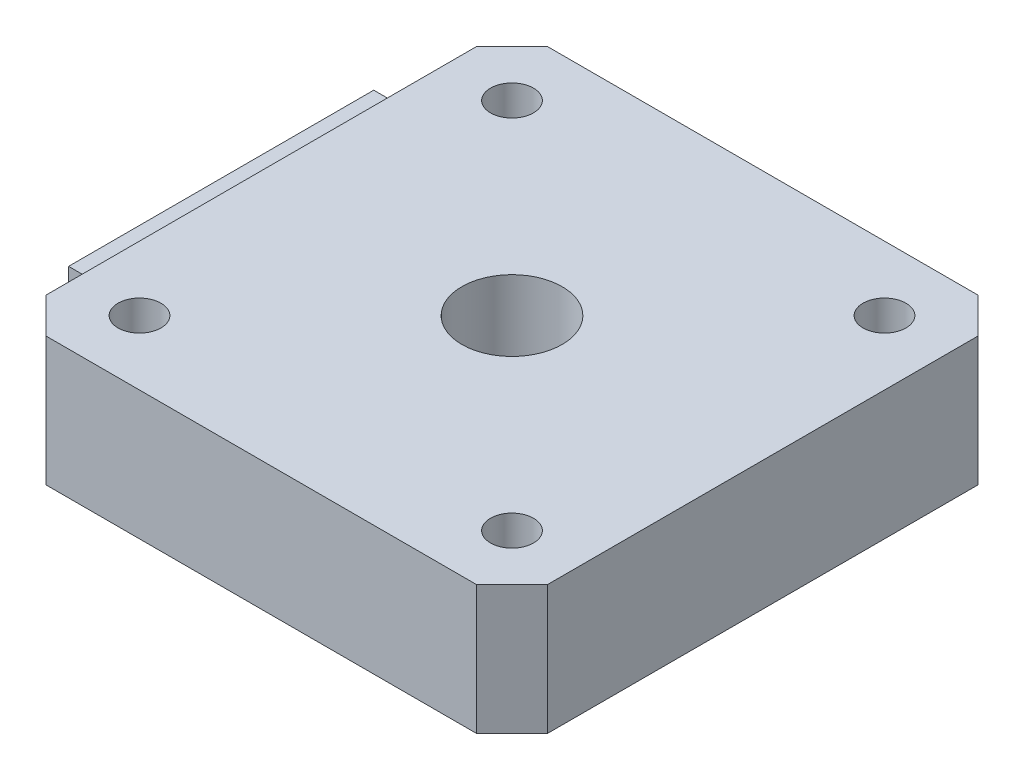
ISO-10303-21;
HEADER;
FILE_DESCRIPTION(('STEP AP214'),'2;1');
FILE_NAME('part.step','',(''),(''),'','','');
FILE_SCHEMA(('AUTOMOTIVE_DESIGN { 1 0 10303 214 1 1 1 1 }'));
ENDSEC;
DATA;
#1=APPLICATION_CONTEXT('core data for automotive mechanical design processes');
#2=APPLICATION_PROTOCOL_DEFINITION('international standard','automotive_design',2000,#1);
#3=PRODUCT_CONTEXT('',#1,'mechanical');
#4=PRODUCT('Part','Part','',(#3));
#5=PRODUCT_RELATED_PRODUCT_CATEGORY('part','',(#4));
#6=PRODUCT_DEFINITION_FORMATION('','',#4);
#7=PRODUCT_DEFINITION_CONTEXT('part definition',#1,'design');
#8=PRODUCT_DEFINITION('design','',#6,#7);
#9=PRODUCT_DEFINITION_SHAPE('','',#8);
#10=(LENGTH_UNIT() NAMED_UNIT(*) SI_UNIT(.MILLI.,.METRE.));
#11=(NAMED_UNIT(*) PLANE_ANGLE_UNIT() SI_UNIT($,.RADIAN.));
#12=(NAMED_UNIT(*) SI_UNIT($,.STERADIAN.) SOLID_ANGLE_UNIT());
#13=UNCERTAINTY_MEASURE_WITH_UNIT(LENGTH_MEASURE(1.E-05),#10,'distance_accuracy_value','');
#14=(GEOMETRIC_REPRESENTATION_CONTEXT(3) GLOBAL_UNCERTAINTY_ASSIGNED_CONTEXT((#13)) GLOBAL_UNIT_ASSIGNED_CONTEXT((#10,
#11,#12)) REPRESENTATION_CONTEXT('',''));
#15=CARTESIAN_POINT('',(0.,0.,0.));
#16=DIRECTION('',(0.,0.,1.));
#17=DIRECTION('',(1.,0.,0.));
#18=AXIS2_PLACEMENT_3D('',#15,#16,#17);
#19=CARTESIAN_POINT('',(0.,9.,-32.5269119345811));
#20=DIRECTION('',(1.,0.,0.));
#21=DIRECTION('',(0.,0.,-1.));
#22=AXIS2_PLACEMENT_3D('',#19,#20,#21);
#23=PLANE('',#22);
#24=DIRECTION('',(0.,1.,0.));
#25=VECTOR('',#24,1.);
#26=CARTESIAN_POINT('',(0.,0.,-6.84999999999995));
#27=LINE('',#26,#25);
#28=CARTESIAN_POINT('',(0.,0.,-6.84999999999995));
#29=VERTEX_POINT('',#28);
#30=CARTESIAN_POINT('',(0.,7.15,-6.84999999999995));
#31=VERTEX_POINT('',#30);
#32=EDGE_CURVE('E179',#29,#31,#27,.T.);
#33=ORIENTED_EDGE('',*,*,#32,.F.);
#34=DIRECTION('',(0.,0.,1.));
#35=VECTOR('',#34,1.);
#36=CARTESIAN_POINT('',(0.,0.,-32.5269119345811));
#37=LINE('',#36,#35);
#38=CARTESIAN_POINT('',(0.,0.,-2.47308806541876));
#39=VERTEX_POINT('',#38);
#40=EDGE_CURVE('E237',#29,#39,#37,.T.);
#41=ORIENTED_EDGE('',*,*,#40,.T.);
#42=DIRECTION('',(0.,-1.,0.));
#43=VECTOR('',#42,1.);
#44=CARTESIAN_POINT('',(0.,9.,-2.47308806541876));
#45=LINE('',#44,#43);
#46=CARTESIAN_POINT('',(0.,9.,-2.47308806541876));
#47=VERTEX_POINT('',#46);
#48=EDGE_CURVE('E11',#47,#39,#45,.T.);
#49=ORIENTED_EDGE('',*,*,#48,.F.);
#50=DIRECTION('',(0.,0.,1.));
#51=VECTOR('',#50,1.);
#52=CARTESIAN_POINT('',(0.,9.,-32.5269119345811));
#53=LINE('',#52,#51);
#54=CARTESIAN_POINT('',(0.,9.,-32.5269119345811));
#55=VERTEX_POINT('',#54);
#56=EDGE_CURVE('E240',#55,#47,#53,.T.);
#57=ORIENTED_EDGE('',*,*,#56,.F.);
#58=DIRECTION('',(0.,-1.,0.));
#59=VECTOR('',#58,1.);
#60=CARTESIAN_POINT('',(0.,9.,-32.5269119345811));
#61=LINE('',#60,#59);
#62=CARTESIAN_POINT('',(0.,0.,-32.5269119345811));
#63=VERTEX_POINT('',#62);
#64=EDGE_CURVE('E258',#55,#63,#61,.T.);
#65=ORIENTED_EDGE('',*,*,#64,.T.);
#66=CARTESIAN_POINT('',(0.,0.,-28.1499999999999));
#67=VERTEX_POINT('',#66);
#68=EDGE_CURVE('E259',#63,#67,#37,.T.);
#69=ORIENTED_EDGE('',*,*,#68,.T.);
#70=DIRECTION('',(0.,-1.,0.));
#71=VECTOR('',#70,1.);
#72=CARTESIAN_POINT('',(0.,0.,-28.1499999999999));
#73=LINE('',#72,#71);
#74=CARTESIAN_POINT('',(0.,7.15,-28.1499999999999));
#75=VERTEX_POINT('',#74);
#76=EDGE_CURVE('E187',#75,#67,#73,.T.);
#77=ORIENTED_EDGE('',*,*,#76,.F.);
#78=DIRECTION('',(0.,0.,-1.));
#79=VECTOR('',#78,1.);
#80=CARTESIAN_POINT('',(0.,7.15,-28.1499999999999));
#81=LINE('',#80,#79);
#82=EDGE_CURVE('E54',#31,#75,#81,.T.);
#83=ORIENTED_EDGE('',*,*,#82,.F.);
#84=EDGE_LOOP('',(#33,#41,#49,#57,#65,#69,#77,#83));
#85=FACE_BOUND('',#84,.T.);
#86=ADVANCED_FACE('F32',(#85),#23,.F.);
#87=CARTESIAN_POINT('',(0.,9.,-2.47308806541876));
#88=DIRECTION('',(0.707106781186549,0.,-0.707106781186546));
#89=DIRECTION('',(-0.707106781186546,0.,-0.707106781186549));
#90=AXIS2_PLACEMENT_3D('',#87,#88,#89);
#91=PLANE('',#90);
#92=DIRECTION('',(0.707106781186546,0.,0.707106781186548));
#93=VECTOR('',#92,1.);
#94=CARTESIAN_POINT('',(0.,0.,-2.47308806541876));
#95=LINE('',#94,#93);
#96=CARTESIAN_POINT('',(2.47308806541877,0.,0.));
#97=VERTEX_POINT('',#96);
#98=EDGE_CURVE('E261',#39,#97,#95,.T.);
#99=ORIENTED_EDGE('',*,*,#98,.T.);
#100=DIRECTION('',(0.,-1.,0.));
#101=VECTOR('',#100,1.);
#102=CARTESIAN_POINT('',(2.47308806541877,9.,0.));
#103=LINE('',#102,#101);
#104=CARTESIAN_POINT('',(2.47308806541877,9.,0.));
#105=VERTEX_POINT('',#104);
#106=EDGE_CURVE('E39',#105,#97,#103,.T.);
#107=ORIENTED_EDGE('',*,*,#106,.F.);
#108=DIRECTION('',(0.707106781186546,0.,0.707106781186548));
#109=VECTOR('',#108,1.);
#110=CARTESIAN_POINT('',(0.,9.,-2.47308806541876));
#111=LINE('',#110,#109);
#112=EDGE_CURVE('E243',#47,#105,#111,.T.);
#113=ORIENTED_EDGE('',*,*,#112,.F.);
#114=ORIENTED_EDGE('',*,*,#48,.T.);
#115=EDGE_LOOP('',(#99,#107,#113,#114));
#116=FACE_BOUND('',#115,.T.);
#117=ADVANCED_FACE('F320',(#116),#91,.F.);
#118=CARTESIAN_POINT('',(2.47308806541877,9.,0.));
#119=DIRECTION('',(0.,0.,-1.));
#120=DIRECTION('',(-1.,0.,0.));
#121=AXIS2_PLACEMENT_3D('',#118,#119,#120);
#122=PLANE('',#121);
#123=DIRECTION('',(1.,0.,0.));
#124=VECTOR('',#123,1.);
#125=CARTESIAN_POINT('',(2.47308806541877,0.,0.));
#126=LINE('',#125,#124);
#127=CARTESIAN_POINT('',(32.5269119345812,0.,0.));
#128=VERTEX_POINT('',#127);
#129=EDGE_CURVE('E263',#97,#128,#126,.T.);
#130=ORIENTED_EDGE('',*,*,#129,.T.);
#131=DIRECTION('',(0.,-1.,0.));
#132=VECTOR('',#131,1.);
#133=CARTESIAN_POINT('',(32.5269119345812,9.,0.));
#134=LINE('',#133,#132);
#135=CARTESIAN_POINT('',(32.5269119345812,9.,0.));
#136=VERTEX_POINT('',#135);
#137=EDGE_CURVE('E288',#136,#128,#134,.T.);
#138=ORIENTED_EDGE('',*,*,#137,.F.);
#139=DIRECTION('',(1.,0.,0.));
#140=VECTOR('',#139,1.);
#141=CARTESIAN_POINT('',(2.47308806541877,9.,0.));
#142=LINE('',#141,#140);
#143=EDGE_CURVE('E246',#105,#136,#142,.T.);
#144=ORIENTED_EDGE('',*,*,#143,.F.);
#145=ORIENTED_EDGE('',*,*,#106,.T.);
#146=EDGE_LOOP('',(#130,#138,#144,#145));
#147=FACE_BOUND('',#146,.T.);
#148=ADVANCED_FACE('F295',(#147),#122,.F.);
#149=CARTESIAN_POINT('',(32.5269119345812,9.,0.));
#150=DIRECTION('',(-0.707106781186545,0.,-0.70710678118655));
#151=DIRECTION('',(-0.70710678118655,0.,0.707106781186545));
#152=AXIS2_PLACEMENT_3D('',#149,#150,#151);
#153=PLANE('',#152);
#154=DIRECTION('',(0.70710678118655,0.,-0.707106781186545));
#155=VECTOR('',#154,1.);
#156=CARTESIAN_POINT('',(32.5269119345812,0.,0.));
#157=LINE('',#156,#155);
#158=CARTESIAN_POINT('',(35.,0.,-2.47308806541876));
#159=VERTEX_POINT('',#158);
#160=EDGE_CURVE('E265',#128,#159,#157,.T.);
#161=ORIENTED_EDGE('',*,*,#160,.T.);
#162=DIRECTION('',(0.,-1.,0.));
#163=VECTOR('',#162,1.);
#164=CARTESIAN_POINT('',(35.,9.,-2.47308806541876));
#165=LINE('',#164,#163);
#166=CARTESIAN_POINT('',(35.,9.,-2.47308806541876));
#167=VERTEX_POINT('',#166);
#168=EDGE_CURVE('E285',#167,#159,#165,.T.);
#169=ORIENTED_EDGE('',*,*,#168,.F.);
#170=DIRECTION('',(0.70710678118655,0.,-0.707106781186545));
#171=VECTOR('',#170,1.);
#172=CARTESIAN_POINT('',(32.5269119345812,9.,0.));
#173=LINE('',#172,#171);
#174=EDGE_CURVE('E248',#136,#167,#173,.T.);
#175=ORIENTED_EDGE('',*,*,#174,.F.);
#176=ORIENTED_EDGE('',*,*,#137,.T.);
#177=EDGE_LOOP('',(#161,#169,#175,#176));
#178=FACE_BOUND('',#177,.T.);
#179=ADVANCED_FACE('F308',(#178),#153,.F.);
#180=CARTESIAN_POINT('',(35.,9.,-2.47308806541876));
#181=DIRECTION('',(-1.,0.,0.));
#182=DIRECTION('',(0.,0.,1.));
#183=AXIS2_PLACEMENT_3D('',#180,#181,#182);
#184=PLANE('',#183);
#185=DIRECTION('',(0.,0.,-1.));
#186=VECTOR('',#185,1.);
#187=CARTESIAN_POINT('',(35.,0.,-2.47308806541876));
#188=LINE('',#187,#186);
#189=CARTESIAN_POINT('',(35.,0.,-32.5269119345811));
#190=VERTEX_POINT('',#189);
#191=EDGE_CURVE('E267',#159,#190,#188,.T.);
#192=ORIENTED_EDGE('',*,*,#191,.T.);
#193=DIRECTION('',(0.,-1.,0.));
#194=VECTOR('',#193,1.);
#195=CARTESIAN_POINT('',(35.,9.,-32.5269119345811));
#196=LINE('',#195,#194);
#197=CARTESIAN_POINT('',(35.,9.,-32.5269119345811));
#198=VERTEX_POINT('',#197);
#199=EDGE_CURVE('E282',#198,#190,#196,.T.);
#200=ORIENTED_EDGE('',*,*,#199,.F.);
#201=DIRECTION('',(0.,0.,-1.));
#202=VECTOR('',#201,1.);
#203=CARTESIAN_POINT('',(35.,9.,-2.47308806541876));
#204=LINE('',#203,#202);
#205=EDGE_CURVE('E250',#167,#198,#204,.T.);
#206=ORIENTED_EDGE('',*,*,#205,.F.);
#207=ORIENTED_EDGE('',*,*,#168,.T.);
#208=EDGE_LOOP('',(#192,#200,#206,#207));
#209=FACE_BOUND('',#208,.T.);
#210=ADVANCED_FACE('F312',(#209),#184,.F.);
#211=CARTESIAN_POINT('',(35.,9.,-32.5269119345811));
#212=DIRECTION('',(-0.707106781186548,0.,0.707106781186547));
#213=DIRECTION('',(0.707106781186547,0.,0.707106781186548));
#214=AXIS2_PLACEMENT_3D('',#211,#212,#213);
#215=PLANE('',#214);
#216=DIRECTION('',(-0.707106781186547,0.,-0.707106781186549));
#217=VECTOR('',#216,1.);
#218=CARTESIAN_POINT('',(35.,0.,-32.5269119345811));
#219=LINE('',#218,#217);
#220=CARTESIAN_POINT('',(32.5269119345812,0.,-34.9999999999999));
#221=VERTEX_POINT('',#220);
#222=EDGE_CURVE('E269',#190,#221,#219,.T.);
#223=ORIENTED_EDGE('',*,*,#222,.T.);
#224=DIRECTION('',(0.,-1.,0.));
#225=VECTOR('',#224,1.);
#226=CARTESIAN_POINT('',(32.5269119345812,9.,-34.9999999999999));
#227=LINE('',#226,#225);
#228=CARTESIAN_POINT('',(32.5269119345812,9.,-34.9999999999999));
#229=VERTEX_POINT('',#228);
#230=EDGE_CURVE('E279',#229,#221,#227,.T.);
#231=ORIENTED_EDGE('',*,*,#230,.F.);
#232=DIRECTION('',(-0.707106781186547,0.,-0.707106781186549));
#233=VECTOR('',#232,1.);
#234=CARTESIAN_POINT('',(35.,9.,-32.5269119345811));
#235=LINE('',#234,#233);
#236=EDGE_CURVE('E252',#198,#229,#235,.T.);
#237=ORIENTED_EDGE('',*,*,#236,.F.);
#238=ORIENTED_EDGE('',*,*,#199,.T.);
#239=EDGE_LOOP('',(#223,#231,#237,#238));
#240=FACE_BOUND('',#239,.T.);
#241=ADVANCED_FACE('F359',(#240),#215,.F.);
#242=CARTESIAN_POINT('',(32.5269119345812,9.,-34.9999999999999));
#243=DIRECTION('',(0.,0.,1.));
#244=DIRECTION('',(1.,0.,0.));
#245=AXIS2_PLACEMENT_3D('',#242,#243,#244);
#246=PLANE('',#245);
#247=DIRECTION('',(-1.,0.,0.));
#248=VECTOR('',#247,1.);
#249=CARTESIAN_POINT('',(32.5269119345812,0.,-34.9999999999999));
#250=LINE('',#249,#248);
#251=CARTESIAN_POINT('',(2.47308806541877,0.,-34.9999999999999));
#252=VERTEX_POINT('',#251);
#253=EDGE_CURVE('E271',#221,#252,#250,.T.);
#254=ORIENTED_EDGE('',*,*,#253,.T.);
#255=DIRECTION('',(0.,-1.,0.));
#256=VECTOR('',#255,1.);
#257=CARTESIAN_POINT('',(2.47308806541877,9.,-34.9999999999999));
#258=LINE('',#257,#256);
#259=CARTESIAN_POINT('',(2.47308806541877,9.,-34.9999999999999));
#260=VERTEX_POINT('',#259);
#261=EDGE_CURVE('E276',#260,#252,#258,.T.);
#262=ORIENTED_EDGE('',*,*,#261,.F.);
#263=DIRECTION('',(-1.,0.,0.));
#264=VECTOR('',#263,1.);
#265=CARTESIAN_POINT('',(32.5269119345812,9.,-34.9999999999999));
#266=LINE('',#265,#264);
#267=EDGE_CURVE('E254',#229,#260,#266,.T.);
#268=ORIENTED_EDGE('',*,*,#267,.F.);
#269=ORIENTED_EDGE('',*,*,#230,.T.);
#270=EDGE_LOOP('',(#254,#262,#268,#269));
#271=FACE_BOUND('',#270,.T.);
#272=ADVANCED_FACE('F362',(#271),#246,.F.);
#273=CARTESIAN_POINT('',(2.47308806541877,9.,-34.9999999999999));
#274=DIRECTION('',(0.707106781186547,0.,0.707106781186548));
#275=DIRECTION('',(0.707106781186548,0.,-0.707106781186547));
#276=AXIS2_PLACEMENT_3D('',#273,#274,#275);
#277=PLANE('',#276);
#278=DIRECTION('',(-0.707106781186549,0.,0.707106781186547));
#279=VECTOR('',#278,1.);
#280=CARTESIAN_POINT('',(2.47308806541877,0.,-34.9999999999999));
#281=LINE('',#280,#279);
#282=EDGE_CURVE('E244',#252,#63,#281,.T.);
#283=ORIENTED_EDGE('',*,*,#282,.T.);
#284=ORIENTED_EDGE('',*,*,#64,.F.);
#285=DIRECTION('',(-0.707106781186549,0.,0.707106781186547));
#286=VECTOR('',#285,1.);
#287=CARTESIAN_POINT('',(2.47308806541877,9.,-34.9999999999999));
#288=LINE('',#287,#286);
#289=EDGE_CURVE('E256',#260,#55,#288,.T.);
#290=ORIENTED_EDGE('',*,*,#289,.F.);
#291=ORIENTED_EDGE('',*,*,#261,.T.);
#292=EDGE_LOOP('',(#283,#284,#290,#291));
#293=FACE_BOUND('',#292,.T.);
#294=ADVANCED_FACE('F366',(#293),#277,.F.);
#295=CARTESIAN_POINT('',(0.,9.,0.));
#296=DIRECTION('',(0.,1.,0.));
#297=DIRECTION('',(0.,0.,1.));
#298=AXIS2_PLACEMENT_3D('',#295,#296,#297);
#299=PLANE('',#298);
#300=CARTESIAN_POINT('',(4.5000000000006,9.,-4.50000000000008));
#301=DIRECTION('',(0.,1.,0.));
#302=DIRECTION('',(0.,0.,1.));
#303=AXIS2_PLACEMENT_3D('',#300,#301,#302);
#304=CIRCLE('',#303,1.5);
#305=CARTESIAN_POINT('',(4.5000000000006,9.,-3.00000000000007));
#306=VERTEX_POINT('',#305);
#307=EDGE_CURVE('E209',#306,#306,#304,.T.);
#308=ORIENTED_EDGE('',*,*,#307,.F.);
#309=EDGE_LOOP('',(#308));
#310=FACE_BOUND('',#309,.T.);
#311=CARTESIAN_POINT('',(30.5000000000006,9.,-4.50000000000058));
#312=DIRECTION('',(0.,1.,0.));
#313=DIRECTION('',(0.,0.,1.));
#314=AXIS2_PLACEMENT_3D('',#311,#312,#313);
#315=CIRCLE('',#314,1.5);
#316=CARTESIAN_POINT('',(30.5000000000006,9.,-3.00000000000058));
#317=VERTEX_POINT('',#316);
#318=EDGE_CURVE('E213',#317,#317,#315,.T.);
#319=ORIENTED_EDGE('',*,*,#318,.F.);
#320=EDGE_LOOP('',(#319));
#321=FACE_BOUND('',#320,.T.);
#322=CARTESIAN_POINT('',(30.5,9.,-30.5000000000006));
#323=DIRECTION('',(0.,1.,0.));
#324=DIRECTION('',(0.,0.,1.));
#325=AXIS2_PLACEMENT_3D('',#322,#323,#324);
#326=CIRCLE('',#325,1.5);
#327=CARTESIAN_POINT('',(30.5,9.,-29.0000000000006));
#328=VERTEX_POINT('',#327);
#329=EDGE_CURVE('E219',#328,#328,#326,.T.);
#330=ORIENTED_EDGE('',*,*,#329,.F.);
#331=EDGE_LOOP('',(#330));
#332=FACE_BOUND('',#331,.T.);
#333=CARTESIAN_POINT('',(4.5,9.,-30.4999999999999));
#334=DIRECTION('',(0.,1.,0.));
#335=DIRECTION('',(0.,0.,1.));
#336=AXIS2_PLACEMENT_3D('',#333,#334,#335);
#337=CIRCLE('',#336,1.5);
#338=CARTESIAN_POINT('',(4.5,9.,-28.9999999999999));
#339=VERTEX_POINT('',#338);
#340=EDGE_CURVE('E225',#339,#339,#337,.T.);
#341=ORIENTED_EDGE('',*,*,#340,.F.);
#342=EDGE_LOOP('',(#341));
#343=FACE_BOUND('',#342,.T.);
#344=CARTESIAN_POINT('',(17.5,9.,-17.4999999999999));
#345=DIRECTION('',(0.,1.,0.));
#346=DIRECTION('',(0.,0.,1.));
#347=AXIS2_PLACEMENT_3D('',#344,#345,#346);
#348=CIRCLE('',#347,3.5);
#349=CARTESIAN_POINT('',(17.5,9.,-13.9999999999999));
#350=VERTEX_POINT('',#349);
#351=EDGE_CURVE('E231',#350,#350,#348,.T.);
#352=ORIENTED_EDGE('',*,*,#351,.F.);
#353=EDGE_LOOP('',(#352));
#354=FACE_BOUND('',#353,.T.);
#355=ORIENTED_EDGE('',*,*,#56,.T.);
#356=ORIENTED_EDGE('',*,*,#112,.T.);
#357=ORIENTED_EDGE('',*,*,#143,.T.);
#358=ORIENTED_EDGE('',*,*,#174,.T.);
#359=ORIENTED_EDGE('',*,*,#205,.T.);
#360=ORIENTED_EDGE('',*,*,#236,.T.);
#361=ORIENTED_EDGE('',*,*,#267,.T.);
#362=ORIENTED_EDGE('',*,*,#289,.T.);
#363=EDGE_LOOP('',(#355,#356,#357,#358,#359,#360,#361,#362));
#364=FACE_BOUND('',#363,.T.);
#365=ADVANCED_FACE('F316',(#310,#321,#332,#343,#354,#364),#299,.T.);
#366=CARTESIAN_POINT('',(0.,0.,0.));
#367=DIRECTION('',(0.,1.,0.));
#368=DIRECTION('',(0.,0.,1.));
#369=AXIS2_PLACEMENT_3D('',#366,#367,#368);
#370=PLANE('',#369);
#371=CARTESIAN_POINT('',(4.5000000000006,0.,-4.50000000000008));
#372=DIRECTION('',(0.,1.,0.));
#373=DIRECTION('',(0.,0.,1.));
#374=AXIS2_PLACEMENT_3D('',#371,#372,#373);
#375=CIRCLE('',#374,1.5);
#376=CARTESIAN_POINT('',(4.5000000000006,0.,-3.00000000000007));
#377=VERTEX_POINT('',#376);
#378=EDGE_CURVE('E210',#377,#377,#375,.T.);
#379=ORIENTED_EDGE('',*,*,#378,.T.);
#380=EDGE_LOOP('',(#379));
#381=FACE_BOUND('',#380,.T.);
#382=CARTESIAN_POINT('',(30.5000000000006,0.,-4.50000000000058));
#383=DIRECTION('',(0.,1.,0.));
#384=DIRECTION('',(0.,0.,1.));
#385=AXIS2_PLACEMENT_3D('',#382,#383,#384);
#386=CIRCLE('',#385,1.5);
#387=CARTESIAN_POINT('',(30.5000000000006,0.,-3.00000000000058));
#388=VERTEX_POINT('',#387);
#389=EDGE_CURVE('E216',#388,#388,#386,.T.);
#390=ORIENTED_EDGE('',*,*,#389,.T.);
#391=EDGE_LOOP('',(#390));
#392=FACE_BOUND('',#391,.T.);
#393=CARTESIAN_POINT('',(30.5,0.,-30.5000000000006));
#394=DIRECTION('',(0.,1.,0.));
#395=DIRECTION('',(0.,0.,1.));
#396=AXIS2_PLACEMENT_3D('',#393,#394,#395);
#397=CIRCLE('',#396,1.5);
#398=CARTESIAN_POINT('',(30.5,0.,-29.0000000000006));
#399=VERTEX_POINT('',#398);
#400=EDGE_CURVE('E222',#399,#399,#397,.T.);
#401=ORIENTED_EDGE('',*,*,#400,.T.);
#402=EDGE_LOOP('',(#401));
#403=FACE_BOUND('',#402,.T.);
#404=CARTESIAN_POINT('',(4.5,0.,-30.4999999999999));
#405=DIRECTION('',(0.,1.,0.));
#406=DIRECTION('',(0.,0.,1.));
#407=AXIS2_PLACEMENT_3D('',#404,#405,#406);
#408=CIRCLE('',#407,1.5);
#409=CARTESIAN_POINT('',(4.5,0.,-28.9999999999999));
#410=VERTEX_POINT('',#409);
#411=EDGE_CURVE('E228',#410,#410,#408,.T.);
#412=ORIENTED_EDGE('',*,*,#411,.T.);
#413=EDGE_LOOP('',(#412));
#414=FACE_BOUND('',#413,.T.);
#415=CARTESIAN_POINT('',(17.5,0.,-17.4999999999999));
#416=DIRECTION('',(0.,1.,0.));
#417=DIRECTION('',(0.,0.,1.));
#418=AXIS2_PLACEMENT_3D('',#415,#416,#417);
#419=CIRCLE('',#418,3.5);
#420=CARTESIAN_POINT('',(17.5,0.,-13.9999999999999));
#421=VERTEX_POINT('',#420);
#422=EDGE_CURVE('E234',#421,#421,#419,.T.);
#423=ORIENTED_EDGE('',*,*,#422,.T.);
#424=EDGE_LOOP('',(#423));
#425=FACE_BOUND('',#424,.T.);
#426=ORIENTED_EDGE('',*,*,#68,.F.);
#427=ORIENTED_EDGE('',*,*,#282,.F.);
#428=ORIENTED_EDGE('',*,*,#253,.F.);
#429=ORIENTED_EDGE('',*,*,#222,.F.);
#430=ORIENTED_EDGE('',*,*,#191,.F.);
#431=ORIENTED_EDGE('',*,*,#160,.F.);
#432=ORIENTED_EDGE('',*,*,#129,.F.);
#433=ORIENTED_EDGE('',*,*,#98,.F.);
#434=ORIENTED_EDGE('',*,*,#40,.F.);
#435=DIRECTION('',(1.,0.,0.));
#436=VECTOR('',#435,1.);
#437=CARTESIAN_POINT('',(-2.8,0.,-6.84999999999995));
#438=LINE('',#437,#436);
#439=CARTESIAN_POINT('',(-2.8,0.,-6.84999999999995));
#440=VERTEX_POINT('',#439);
#441=EDGE_CURVE('E193',#440,#29,#438,.T.);
#442=ORIENTED_EDGE('',*,*,#441,.F.);
#443=DIRECTION('',(0.,0.,1.));
#444=VECTOR('',#443,1.);
#445=CARTESIAN_POINT('',(-2.8,0.,-28.1499999999999));
#446=LINE('',#445,#444);
#447=CARTESIAN_POINT('',(-2.8,0.,-28.1499999999999));
#448=VERTEX_POINT('',#447);
#449=EDGE_CURVE('E191',#448,#440,#446,.T.);
#450=ORIENTED_EDGE('',*,*,#449,.F.);
#451=DIRECTION('',(1.,0.,0.));
#452=VECTOR('',#451,1.);
#453=CARTESIAN_POINT('',(-2.8,0.,-28.1499999999999));
#454=LINE('',#453,#452);
#455=EDGE_CURVE('E201',#448,#67,#454,.T.);
#456=ORIENTED_EDGE('',*,*,#455,.T.);
#457=EDGE_LOOP('',(#426,#427,#428,#429,#430,#431,#432,#433,#434,#442,#450,#456));
#458=FACE_BOUND('',#457,.T.);
#459=ADVANCED_FACE('F302',(#381,#392,#403,#414,#425,#458),#370,.F.);
#460=CARTESIAN_POINT('',(17.5,0.,-17.4999999999999));
#461=DIRECTION('',(0.,1.,0.));
#462=DIRECTION('',(0.,0.,1.));
#463=AXIS2_PLACEMENT_3D('',#460,#461,#462);
#464=CYLINDRICAL_SURFACE('',#463,3.5);
#465=ORIENTED_EDGE('',*,*,#422,.F.);
#466=EDGE_LOOP('',(#465));
#467=FACE_BOUND('',#466,.T.);
#468=ORIENTED_EDGE('',*,*,#351,.T.);
#469=EDGE_LOOP('',(#468));
#470=FACE_BOUND('',#469,.T.);
#471=ADVANCED_FACE('F373',(#467,#470),#464,.F.);
#472=CARTESIAN_POINT('',(4.5,0.,-30.4999999999999));
#473=DIRECTION('',(0.,1.,0.));
#474=DIRECTION('',(0.,0.,1.));
#475=AXIS2_PLACEMENT_3D('',#472,#473,#474);
#476=CYLINDRICAL_SURFACE('',#475,1.5);
#477=ORIENTED_EDGE('',*,*,#411,.F.);
#478=EDGE_LOOP('',(#477));
#479=FACE_BOUND('',#478,.T.);
#480=ORIENTED_EDGE('',*,*,#340,.T.);
#481=EDGE_LOOP('',(#480));
#482=FACE_BOUND('',#481,.T.);
#483=ADVANCED_FACE('F380',(#479,#482),#476,.F.);
#484=CARTESIAN_POINT('',(30.5,0.,-30.5000000000006));
#485=DIRECTION('',(0.,1.,0.));
#486=DIRECTION('',(0.,0.,1.));
#487=AXIS2_PLACEMENT_3D('',#484,#485,#486);
#488=CYLINDRICAL_SURFACE('',#487,1.5);
#489=ORIENTED_EDGE('',*,*,#400,.F.);
#490=EDGE_LOOP('',(#489));
#491=FACE_BOUND('',#490,.T.);
#492=ORIENTED_EDGE('',*,*,#329,.T.);
#493=EDGE_LOOP('',(#492));
#494=FACE_BOUND('',#493,.T.);
#495=ADVANCED_FACE('F384',(#491,#494),#488,.F.);
#496=CARTESIAN_POINT('',(30.5000000000006,0.,-4.50000000000058));
#497=DIRECTION('',(0.,1.,0.));
#498=DIRECTION('',(0.,0.,1.));
#499=AXIS2_PLACEMENT_3D('',#496,#497,#498);
#500=CYLINDRICAL_SURFACE('',#499,1.5);
#501=ORIENTED_EDGE('',*,*,#389,.F.);
#502=EDGE_LOOP('',(#501));
#503=FACE_BOUND('',#502,.T.);
#504=ORIENTED_EDGE('',*,*,#318,.T.);
#505=EDGE_LOOP('',(#504));
#506=FACE_BOUND('',#505,.T.);
#507=ADVANCED_FACE('F388',(#503,#506),#500,.F.);
#508=CARTESIAN_POINT('',(4.5000000000006,0.,-4.50000000000008));
#509=DIRECTION('',(0.,1.,0.));
#510=DIRECTION('',(0.,0.,1.));
#511=AXIS2_PLACEMENT_3D('',#508,#509,#510);
#512=CYLINDRICAL_SURFACE('',#511,1.5);
#513=ORIENTED_EDGE('',*,*,#378,.F.);
#514=EDGE_LOOP('',(#513));
#515=FACE_BOUND('',#514,.T.);
#516=ORIENTED_EDGE('',*,*,#307,.T.);
#517=EDGE_LOOP('',(#516));
#518=FACE_BOUND('',#517,.T.);
#519=ADVANCED_FACE('F344',(#515,#518),#512,.F.);
#520=CARTESIAN_POINT('',(-2.8,0.,-6.84999999999995));
#521=DIRECTION('',(0.,0.,-1.));
#522=DIRECTION('',(-1.,0.,0.));
#523=AXIS2_PLACEMENT_3D('',#520,#521,#522);
#524=PLANE('',#523);
#525=ORIENTED_EDGE('',*,*,#32,.T.);
#526=DIRECTION('',(1.,0.,0.));
#527=VECTOR('',#526,1.);
#528=CARTESIAN_POINT('',(-2.8,7.15,-6.84999999999995));
#529=LINE('',#528,#527);
#530=CARTESIAN_POINT('',(-2.8,7.15,-6.84999999999995));
#531=VERTEX_POINT('',#530);
#532=EDGE_CURVE('E207',#531,#31,#529,.T.);
#533=ORIENTED_EDGE('',*,*,#532,.F.);
#534=DIRECTION('',(0.,1.,0.));
#535=VECTOR('',#534,1.);
#536=CARTESIAN_POINT('',(-2.8,0.,-6.84999999999995));
#537=LINE('',#536,#535);
#538=EDGE_CURVE('E183',#440,#531,#537,.T.);
#539=ORIENTED_EDGE('',*,*,#538,.F.);
#540=ORIENTED_EDGE('',*,*,#441,.T.);
#541=EDGE_LOOP('',(#525,#533,#539,#540));
#542=FACE_BOUND('',#541,.T.);
#543=ADVANCED_FACE('F325',(#542),#524,.F.);
#544=CARTESIAN_POINT('',(-2.8,7.15,-28.1499999999999));
#545=DIRECTION('',(0.,-1.,0.));
#546=DIRECTION('',(0.,0.,-1.));
#547=AXIS2_PLACEMENT_3D('',#544,#545,#546);
#548=PLANE('',#547);
#549=ORIENTED_EDGE('',*,*,#82,.T.);
#550=DIRECTION('',(1.,0.,0.));
#551=VECTOR('',#550,1.);
#552=CARTESIAN_POINT('',(-2.8,7.15,-28.1499999999999));
#553=LINE('',#552,#551);
#554=CARTESIAN_POINT('',(-2.8,7.15,-28.1499999999999));
#555=VERTEX_POINT('',#554);
#556=EDGE_CURVE('E204',#555,#75,#553,.T.);
#557=ORIENTED_EDGE('',*,*,#556,.F.);
#558=DIRECTION('',(0.,0.,-1.));
#559=VECTOR('',#558,1.);
#560=CARTESIAN_POINT('',(-2.8,7.15,-28.1499999999999));
#561=LINE('',#560,#559);
#562=EDGE_CURVE('E186',#531,#555,#561,.T.);
#563=ORIENTED_EDGE('',*,*,#562,.F.);
#564=ORIENTED_EDGE('',*,*,#532,.T.);
#565=EDGE_LOOP('',(#549,#557,#563,#564));
#566=FACE_BOUND('',#565,.T.);
#567=ADVANCED_FACE('F336',(#566),#548,.F.);
#568=CARTESIAN_POINT('',(-2.8,0.,-28.1499999999999));
#569=DIRECTION('',(0.,0.,1.));
#570=DIRECTION('',(1.,0.,0.));
#571=AXIS2_PLACEMENT_3D('',#568,#569,#570);
#572=PLANE('',#571);
#573=ORIENTED_EDGE('',*,*,#76,.T.);
#574=ORIENTED_EDGE('',*,*,#455,.F.);
#575=DIRECTION('',(0.,-1.,0.));
#576=VECTOR('',#575,1.);
#577=CARTESIAN_POINT('',(-2.8,0.,-28.1499999999999));
#578=LINE('',#577,#576);
#579=EDGE_CURVE('E189',#555,#448,#578,.T.);
#580=ORIENTED_EDGE('',*,*,#579,.F.);
#581=ORIENTED_EDGE('',*,*,#556,.T.);
#582=EDGE_LOOP('',(#573,#574,#580,#581));
#583=FACE_BOUND('',#582,.T.);
#584=ADVANCED_FACE('F334',(#583),#572,.F.);
#585=CARTESIAN_POINT('',(-2.8,0.,0.));
#586=DIRECTION('',(1.,0.,0.));
#587=DIRECTION('',(0.,0.,-1.));
#588=AXIS2_PLACEMENT_3D('',#585,#586,#587);
#589=PLANE('',#588);
#590=DIRECTION('',(0.,0.,-1.));
#591=VECTOR('',#590,1.);
#592=CARTESIAN_POINT('',(-2.8,6.575,-27.4999999999999));
#593=LINE('',#592,#591);
#594=CARTESIAN_POINT('',(-2.8,6.575,-7.49999999999994));
#595=VERTEX_POINT('',#594);
#596=CARTESIAN_POINT('',(-2.8,6.575,-27.4999999999999));
#597=VERTEX_POINT('',#596);
#598=EDGE_CURVE('E173',#595,#597,#593,.T.);
#599=ORIENTED_EDGE('',*,*,#598,.F.);
#600=DIRECTION('',(0.,1.,0.));
#601=VECTOR('',#600,1.);
#602=CARTESIAN_POINT('',(-2.8,0.575,-7.49999999999994));
#603=LINE('',#602,#601);
#604=CARTESIAN_POINT('',(-2.8,0.575,-7.49999999999994));
#605=VERTEX_POINT('',#604);
#606=EDGE_CURVE('E46',#605,#595,#603,.T.);
#607=ORIENTED_EDGE('',*,*,#606,.F.);
#608=DIRECTION('',(0.,0.,1.));
#609=VECTOR('',#608,1.);
#610=CARTESIAN_POINT('',(-2.8,0.575,-27.4999999999999));
#611=LINE('',#610,#609);
#612=CARTESIAN_POINT('',(-2.8,0.575,-27.4999999999999));
#613=VERTEX_POINT('',#612);
#614=EDGE_CURVE('E164',#613,#605,#611,.T.);
#615=ORIENTED_EDGE('',*,*,#614,.F.);
#616=DIRECTION('',(0.,-1.,0.));
#617=VECTOR('',#616,1.);
#618=CARTESIAN_POINT('',(-2.8,0.575,-27.4999999999999));
#619=LINE('',#618,#617);
#620=EDGE_CURVE('E167',#597,#613,#619,.T.);
#621=ORIENTED_EDGE('',*,*,#620,.F.);
#622=EDGE_LOOP('',(#599,#607,#615,#621));
#623=FACE_BOUND('',#622,.T.);
#624=ORIENTED_EDGE('',*,*,#538,.T.);
#625=ORIENTED_EDGE('',*,*,#562,.T.);
#626=ORIENTED_EDGE('',*,*,#579,.T.);
#627=ORIENTED_EDGE('',*,*,#449,.T.);
#628=EDGE_LOOP('',(#624,#625,#626,#627));
#629=FACE_BOUND('',#628,.T.);
#630=ADVANCED_FACE('F328',(#623,#629),#589,.F.);
#631=CARTESIAN_POINT('',(0.,0.575,-7.49999999999994));
#632=DIRECTION('',(0.,0.,1.));
#633=DIRECTION('',(1.,0.,0.));
#634=AXIS2_PLACEMENT_3D('',#631,#632,#633);
#635=PLANE('',#634);
#636=ORIENTED_EDGE('',*,*,#606,.T.);
#637=DIRECTION('',(-1.,0.,0.));
#638=VECTOR('',#637,1.);
#639=CARTESIAN_POINT('',(0.,6.575,-7.49999999999994));
#640=LINE('',#639,#638);
#641=CARTESIAN_POINT('',(0.,6.575,-7.49999999999994));
#642=VERTEX_POINT('',#641);
#643=EDGE_CURVE('E142',#642,#595,#640,.T.);
#644=ORIENTED_EDGE('',*,*,#643,.F.);
#645=DIRECTION('',(0.,1.,0.));
#646=VECTOR('',#645,1.);
#647=CARTESIAN_POINT('',(0.,0.575,-7.49999999999994));
#648=LINE('',#647,#646);
#649=CARTESIAN_POINT('',(0.,0.575,-7.49999999999994));
#650=VERTEX_POINT('',#649);
#651=EDGE_CURVE('E146',#650,#642,#648,.T.);
#652=ORIENTED_EDGE('',*,*,#651,.F.);
#653=DIRECTION('',(-1.,0.,0.));
#654=VECTOR('',#653,1.);
#655=CARTESIAN_POINT('',(0.,0.575,-7.49999999999994));
#656=LINE('',#655,#654);
#657=EDGE_CURVE('E177',#650,#605,#656,.T.);
#658=ORIENTED_EDGE('',*,*,#657,.T.);
#659=EDGE_LOOP('',(#636,#644,#652,#658));
#660=FACE_BOUND('',#659,.T.);
#661=ADVANCED_FACE('F144',(#660),#635,.F.);
#662=CARTESIAN_POINT('',(0.,0.575,-27.4999999999999));
#663=DIRECTION('',(0.,-1.,0.));
#664=DIRECTION('',(0.,0.,-1.));
#665=AXIS2_PLACEMENT_3D('',#662,#663,#664);
#666=PLANE('',#665);
#667=ORIENTED_EDGE('',*,*,#614,.T.);
#668=ORIENTED_EDGE('',*,*,#657,.F.);
#669=DIRECTION('',(0.,0.,1.));
#670=VECTOR('',#669,1.);
#671=CARTESIAN_POINT('',(0.,0.575,-27.4999999999999));
#672=LINE('',#671,#670);
#673=CARTESIAN_POINT('',(0.,0.575,-27.4999999999999));
#674=VERTEX_POINT('',#673);
#675=EDGE_CURVE('E152',#674,#650,#672,.T.);
#676=ORIENTED_EDGE('',*,*,#675,.F.);
#677=DIRECTION('',(-1.,0.,0.));
#678=VECTOR('',#677,1.);
#679=CARTESIAN_POINT('',(0.,0.575,-27.4999999999999));
#680=LINE('',#679,#678);
#681=EDGE_CURVE('E180',#674,#613,#680,.T.);
#682=ORIENTED_EDGE('',*,*,#681,.T.);
#683=EDGE_LOOP('',(#667,#668,#676,#682));
#684=FACE_BOUND('',#683,.T.);
#685=ADVANCED_FACE('F457',(#684),#666,.F.);
#686=CARTESIAN_POINT('',(0.,0.575,-27.4999999999999));
#687=DIRECTION('',(0.,0.,-1.));
#688=DIRECTION('',(-1.,0.,0.));
#689=AXIS2_PLACEMENT_3D('',#686,#687,#688);
#690=PLANE('',#689);
#691=ORIENTED_EDGE('',*,*,#620,.T.);
#692=ORIENTED_EDGE('',*,*,#681,.F.);
#693=DIRECTION('',(0.,-1.,0.));
#694=VECTOR('',#693,1.);
#695=CARTESIAN_POINT('',(0.,0.575,-27.4999999999999));
#696=LINE('',#695,#694);
#697=CARTESIAN_POINT('',(0.,6.575,-27.4999999999999));
#698=VERTEX_POINT('',#697);
#699=EDGE_CURVE('E160',#698,#674,#696,.T.);
#700=ORIENTED_EDGE('',*,*,#699,.F.);
#701=DIRECTION('',(-1.,0.,0.));
#702=VECTOR('',#701,1.);
#703=CARTESIAN_POINT('',(0.,6.575,-27.4999999999999));
#704=LINE('',#703,#702);
#705=EDGE_CURVE('E151',#698,#597,#704,.T.);
#706=ORIENTED_EDGE('',*,*,#705,.T.);
#707=EDGE_LOOP('',(#691,#692,#700,#706));
#708=FACE_BOUND('',#707,.T.);
#709=ADVANCED_FACE('F466',(#708),#690,.F.);
#710=CARTESIAN_POINT('',(0.,6.575,-27.4999999999999));
#711=DIRECTION('',(0.,1.,0.));
#712=DIRECTION('',(0.,0.,1.));
#713=AXIS2_PLACEMENT_3D('',#710,#711,#712);
#714=PLANE('',#713);
#715=ORIENTED_EDGE('',*,*,#598,.T.);
#716=ORIENTED_EDGE('',*,*,#705,.F.);
#717=DIRECTION('',(0.,0.,-1.));
#718=VECTOR('',#717,1.);
#719=CARTESIAN_POINT('',(0.,6.575,-27.4999999999999));
#720=LINE('',#719,#718);
#721=EDGE_CURVE('E155',#642,#698,#720,.T.);
#722=ORIENTED_EDGE('',*,*,#721,.F.);
#723=ORIENTED_EDGE('',*,*,#643,.T.);
#724=EDGE_LOOP('',(#715,#716,#722,#723));
#725=FACE_BOUND('',#724,.T.);
#726=ADVANCED_FACE('F156',(#725),#714,.F.);
#727=CARTESIAN_POINT('',(0.,0.,0.));
#728=DIRECTION('',(1.,0.,0.));
#729=DIRECTION('',(0.,0.,-1.));
#730=AXIS2_PLACEMENT_3D('',#727,#728,#729);
#731=PLANE('',#730);
#732=ORIENTED_EDGE('',*,*,#651,.T.);
#733=ORIENTED_EDGE('',*,*,#721,.T.);
#734=ORIENTED_EDGE('',*,*,#699,.T.);
#735=ORIENTED_EDGE('',*,*,#675,.T.);
#736=EDGE_LOOP('',(#732,#733,#734,#735));
#737=FACE_BOUND('',#736,.T.);
#738=ADVANCED_FACE('F162',(#737),#731,.F.);
#739=CLOSED_SHELL('',(#86,#117,#148,#179,#210,#241,#272,#294,#365,#459,#471,#483,#495,#507,#519,
#543,#567,#584,#630,#661,#685,#709,#726,#738));
#740=MANIFOLD_SOLID_BREP('B2',#739);
#741=ADVANCED_BREP_SHAPE_REPRESENTATION('',(#18,#740),#14);
#742=SHAPE_DEFINITION_REPRESENTATION(#9,#741);
ENDSEC;
END-ISO-10303-21;
